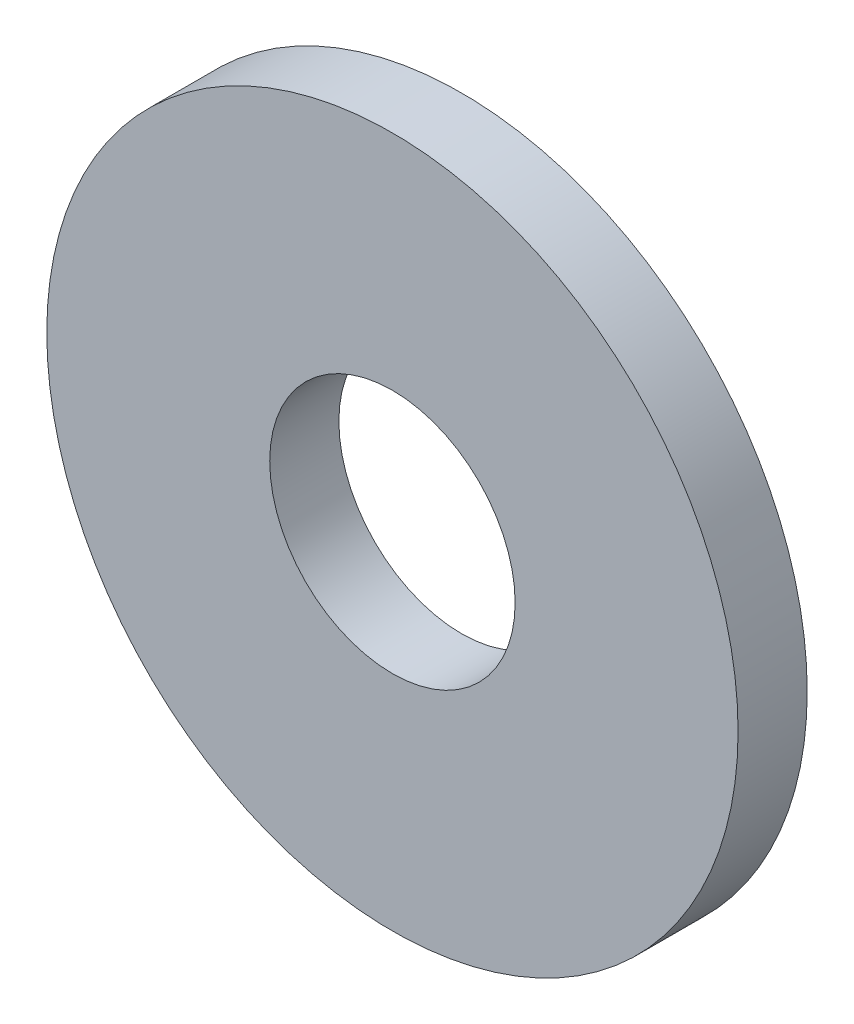
ISO-10303-21;
HEADER;
FILE_DESCRIPTION(('STEP AP214'),'2;1');
FILE_NAME('part.step','',(''),(''),'','','');
FILE_SCHEMA(('AUTOMOTIVE_DESIGN { 1 0 10303 214 1 1 1 1 }'));
ENDSEC;
DATA;
#1=APPLICATION_CONTEXT('core data for automotive mechanical design processes');
#2=APPLICATION_PROTOCOL_DEFINITION('international standard','automotive_design',2000,#1);
#3=PRODUCT_CONTEXT('',#1,'mechanical');
#4=PRODUCT('Part','Part','',(#3));
#5=PRODUCT_RELATED_PRODUCT_CATEGORY('part','',(#4));
#6=PRODUCT_DEFINITION_FORMATION('','',#4);
#7=PRODUCT_DEFINITION_CONTEXT('part definition',#1,'design');
#8=PRODUCT_DEFINITION('design','',#6,#7);
#9=PRODUCT_DEFINITION_SHAPE('','',#8);
#10=(LENGTH_UNIT() NAMED_UNIT(*) SI_UNIT(.MILLI.,.METRE.));
#11=(NAMED_UNIT(*) PLANE_ANGLE_UNIT() SI_UNIT($,.RADIAN.));
#12=(NAMED_UNIT(*) SI_UNIT($,.STERADIAN.) SOLID_ANGLE_UNIT());
#13=UNCERTAINTY_MEASURE_WITH_UNIT(LENGTH_MEASURE(1.E-05),#10,'distance_accuracy_value','');
#14=(GEOMETRIC_REPRESENTATION_CONTEXT(3) GLOBAL_UNCERTAINTY_ASSIGNED_CONTEXT((#13)) GLOBAL_UNIT_ASSIGNED_CONTEXT((#10,
#11,#12)) REPRESENTATION_CONTEXT('',''));
#15=CARTESIAN_POINT('',(0.,0.,0.));
#16=DIRECTION('',(0.,0.,1.));
#17=DIRECTION('',(1.,0.,0.));
#18=AXIS2_PLACEMENT_3D('',#15,#16,#17);
#19=CARTESIAN_POINT('',(2902.24150280177,1052.8676805929,-40.));
#20=DIRECTION('',(0.,0.,1.));
#21=DIRECTION('',(1.,0.,0.));
#22=AXIS2_PLACEMENT_3D('',#19,#20,#21);
#23=CYLINDRICAL_SURFACE('',#22,200.);
#24=CARTESIAN_POINT('',(2902.24150280177,1052.8676805929,-40.));
#25=DIRECTION('',(0.,0.,1.));
#26=DIRECTION('',(1.,0.,0.));
#27=AXIS2_PLACEMENT_3D('',#24,#25,#26);
#28=CIRCLE('',#27,200.);
#29=CARTESIAN_POINT('',(3102.24150280177,1052.8676805929,-40.));
#30=VERTEX_POINT('',#29);
#31=EDGE_CURVE('E10',#30,#30,#28,.T.);
#32=ORIENTED_EDGE('',*,*,#31,.T.);
#33=EDGE_LOOP('',(#32));
#34=FACE_BOUND('',#33,.T.);
#35=CARTESIAN_POINT('',(2902.24150280177,1052.8676805929,0.));
#36=DIRECTION('',(0.,0.,1.));
#37=DIRECTION('',(1.,0.,0.));
#38=AXIS2_PLACEMENT_3D('',#35,#36,#37);
#39=CIRCLE('',#38,200.);
#40=CARTESIAN_POINT('',(3102.24150280177,1052.8676805929,0.));
#41=VERTEX_POINT('',#40);
#42=EDGE_CURVE('E39',#41,#41,#39,.T.);
#43=ORIENTED_EDGE('',*,*,#42,.F.);
#44=EDGE_LOOP('',(#43));
#45=FACE_BOUND('',#44,.T.);
#46=ADVANCED_FACE('F36',(#34,#45),#23,.T.);
#47=CARTESIAN_POINT('',(2902.24150280177,1052.8676805929,-40.));
#48=DIRECTION('',(0.,0.,1.));
#49=DIRECTION('',(1.,0.,0.));
#50=AXIS2_PLACEMENT_3D('',#47,#48,#49);
#51=PLANE('',#50);
#52=CARTESIAN_POINT('',(2902.24150280177,1052.8676805929,-40.));
#53=DIRECTION('',(0.,0.,1.));
#54=DIRECTION('',(1.,0.,0.));
#55=AXIS2_PLACEMENT_3D('',#52,#53,#54);
#56=CIRCLE('',#55,71.0000000000003);
#57=CARTESIAN_POINT('',(2973.24150280177,1052.8676805929,-40.));
#58=VERTEX_POINT('',#57);
#59=EDGE_CURVE('E46',#58,#58,#56,.T.);
#60=ORIENTED_EDGE('',*,*,#59,.T.);
#61=EDGE_LOOP('',(#60));
#62=FACE_BOUND('',#61,.T.);
#63=ORIENTED_EDGE('',*,*,#31,.F.);
#64=EDGE_LOOP('',(#63));
#65=FACE_BOUND('',#64,.T.);
#66=ADVANCED_FACE('F54',(#62,#65),#51,.F.);
#67=CARTESIAN_POINT('',(2902.24150280177,1052.8676805929,0.));
#68=DIRECTION('',(0.,0.,1.));
#69=DIRECTION('',(1.,0.,0.));
#70=AXIS2_PLACEMENT_3D('',#67,#68,#69);
#71=PLANE('',#70);
#72=CARTESIAN_POINT('',(2902.24150280177,1052.8676805929,0.));
#73=DIRECTION('',(0.,0.,1.));
#74=DIRECTION('',(1.,0.,0.));
#75=AXIS2_PLACEMENT_3D('',#72,#73,#74);
#76=CIRCLE('',#75,71.0000000000003);
#77=CARTESIAN_POINT('',(2973.24150280177,1052.8676805929,0.));
#78=VERTEX_POINT('',#77);
#79=EDGE_CURVE('E48',#78,#78,#76,.T.);
#80=ORIENTED_EDGE('',*,*,#79,.F.);
#81=EDGE_LOOP('',(#80));
#82=FACE_BOUND('',#81,.T.);
#83=ORIENTED_EDGE('',*,*,#42,.T.);
#84=EDGE_LOOP('',(#83));
#85=FACE_BOUND('',#84,.T.);
#86=ADVANCED_FACE('F60',(#82,#85),#71,.T.);
#87=CARTESIAN_POINT('',(2902.24150280177,1052.8676805929,-40.));
#88=DIRECTION('',(0.,0.,1.));
#89=DIRECTION('',(1.,0.,0.));
#90=AXIS2_PLACEMENT_3D('',#87,#88,#89);
#91=CYLINDRICAL_SURFACE('',#90,71.0000000000003);
#92=ORIENTED_EDGE('',*,*,#59,.F.);
#93=EDGE_LOOP('',(#92));
#94=FACE_BOUND('',#93,.T.);
#95=ORIENTED_EDGE('',*,*,#79,.T.);
#96=EDGE_LOOP('',(#95));
#97=FACE_BOUND('',#96,.T.);
#98=ADVANCED_FACE('F57',(#94,#97),#91,.F.);
#99=CLOSED_SHELL('',(#46,#66,#86,#98));
#100=MANIFOLD_SOLID_BREP('B2',#99);
#101=ADVANCED_BREP_SHAPE_REPRESENTATION('',(#18,#100),#14);
#102=SHAPE_DEFINITION_REPRESENTATION(#9,#101);
ENDSEC;
END-ISO-10303-21;
